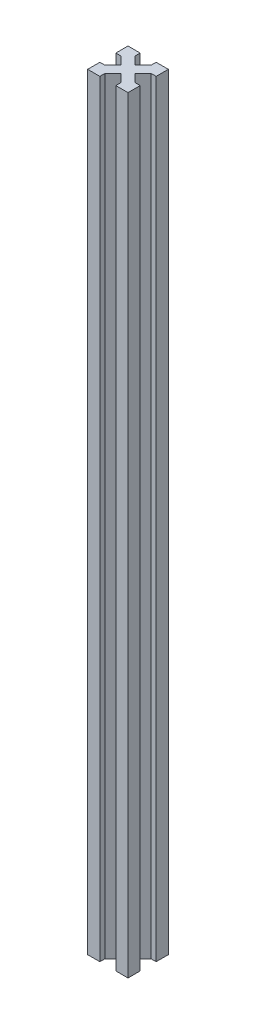
ISO-10303-21;
HEADER;
FILE_DESCRIPTION(('STEP AP214'),'2;1');
FILE_NAME('part.step','',(''),(''),'','','');
FILE_SCHEMA(('AUTOMOTIVE_DESIGN { 1 0 10303 214 1 1 1 1 }'));
ENDSEC;
DATA;
#1=APPLICATION_CONTEXT('core data for automotive mechanical design processes');
#2=APPLICATION_PROTOCOL_DEFINITION('international standard','automotive_design',2000,#1);
#3=PRODUCT_CONTEXT('',#1,'mechanical');
#4=PRODUCT('Part','Part','',(#3));
#5=PRODUCT_RELATED_PRODUCT_CATEGORY('part','',(#4));
#6=PRODUCT_DEFINITION_FORMATION('','',#4);
#7=PRODUCT_DEFINITION_CONTEXT('part definition',#1,'design');
#8=PRODUCT_DEFINITION('design','',#6,#7);
#9=PRODUCT_DEFINITION_SHAPE('','',#8);
#10=(LENGTH_UNIT() NAMED_UNIT(*) SI_UNIT(.MILLI.,.METRE.));
#11=(NAMED_UNIT(*) PLANE_ANGLE_UNIT() SI_UNIT($,.RADIAN.));
#12=(NAMED_UNIT(*) SI_UNIT($,.STERADIAN.) SOLID_ANGLE_UNIT());
#13=UNCERTAINTY_MEASURE_WITH_UNIT(LENGTH_MEASURE(1.E-05),#10,'distance_accuracy_value','');
#14=(GEOMETRIC_REPRESENTATION_CONTEXT(3) GLOBAL_UNCERTAINTY_ASSIGNED_CONTEXT((#13)) GLOBAL_UNIT_ASSIGNED_CONTEXT((#10,
#11,#12)) REPRESENTATION_CONTEXT('',''));
#15=CARTESIAN_POINT('',(0.,0.,0.));
#16=DIRECTION('',(0.,0.,1.));
#17=DIRECTION('',(1.,0.,0.));
#18=AXIS2_PLACEMENT_3D('',#15,#16,#17);
#19=CARTESIAN_POINT('',(-11.7677669529664,380.,-11.7677669529664));
#20=DIRECTION('',(0.707106781186548,0.,0.707106781186547));
#21=DIRECTION('',(0.707106781186547,0.,-0.707106781186548));
#22=AXIS2_PLACEMENT_3D('',#19,#20,#21);
#23=PLANE('',#22);
#24=DIRECTION('',(-0.707106781186547,0.,0.707106781186548));
#25=VECTOR('',#24,1.);
#26=CARTESIAN_POINT('',(-11.7677669529664,0.,-11.7677669529664));
#27=LINE('',#26,#25);
#28=CARTESIAN_POINT('',(-13.5355339059327,0.,-10.));
#29=VERTEX_POINT('',#28);
#30=CARTESIAN_POINT('',(-17.5,0.,-6.03553390593274));
#31=VERTEX_POINT('',#30);
#32=EDGE_CURVE('E231',#29,#31,#27,.T.);
#33=ORIENTED_EDGE('',*,*,#32,.T.);
#34=DIRECTION('',(0.,-1.,0.));
#35=VECTOR('',#34,1.);
#36=CARTESIAN_POINT('',(-17.5,380.,-6.03553390593274));
#37=LINE('',#36,#35);
#38=CARTESIAN_POINT('',(-17.5,380.,-6.03553390593274));
#39=VERTEX_POINT('',#38);
#40=EDGE_CURVE('E11',#39,#31,#37,.T.);
#41=ORIENTED_EDGE('',*,*,#40,.F.);
#42=DIRECTION('',(-0.707106781186547,0.,0.707106781186548));
#43=VECTOR('',#42,1.);
#44=CARTESIAN_POINT('',(-11.7677669529664,380.,-11.7677669529664));
#45=LINE('',#44,#43);
#46=CARTESIAN_POINT('',(-13.5355339059327,380.,-10.));
#47=VERTEX_POINT('',#46);
#48=EDGE_CURVE('E294',#47,#39,#45,.T.);
#49=ORIENTED_EDGE('',*,*,#48,.F.);
#50=DIRECTION('',(0.,-1.,0.));
#51=VECTOR('',#50,1.);
#52=CARTESIAN_POINT('',(-13.5355339059327,380.,-10.));
#53=LINE('',#52,#51);
#54=EDGE_CURVE('E227',#47,#29,#53,.T.);
#55=ORIENTED_EDGE('',*,*,#54,.T.);
#56=EDGE_LOOP('',(#33,#41,#49,#55));
#57=FACE_BOUND('',#56,.T.);
#58=ADVANCED_FACE('F41',(#57),#23,.F.);
#59=CARTESIAN_POINT('',(0.,380.,-6.03553390593274));
#60=DIRECTION('',(0.,0.,1.));
#61=DIRECTION('',(1.,0.,0.));
#62=AXIS2_PLACEMENT_3D('',#59,#60,#61);
#63=PLANE('',#62);
#64=DIRECTION('',(-1.,0.,0.));
#65=VECTOR('',#64,1.);
#66=CARTESIAN_POINT('',(0.,0.,-6.03553390593274));
#67=LINE('',#66,#65);
#68=CARTESIAN_POINT('',(-20.,0.,-6.03553390593274));
#69=VERTEX_POINT('',#68);
#70=EDGE_CURVE('E234',#31,#69,#67,.T.);
#71=ORIENTED_EDGE('',*,*,#70,.T.);
#72=DIRECTION('',(0.,-1.,0.));
#73=VECTOR('',#72,1.);
#74=CARTESIAN_POINT('',(-20.,380.,-6.03553390593274));
#75=LINE('',#74,#73);
#76=CARTESIAN_POINT('',(-20.,380.,-6.03553390593274));
#77=VERTEX_POINT('',#76);
#78=EDGE_CURVE('E49',#77,#69,#75,.T.);
#79=ORIENTED_EDGE('',*,*,#78,.F.);
#80=DIRECTION('',(-1.,0.,0.));
#81=VECTOR('',#80,1.);
#82=CARTESIAN_POINT('',(0.,380.,-6.03553390593274));
#83=LINE('',#82,#81);
#84=EDGE_CURVE('E144',#39,#77,#83,.T.);
#85=ORIENTED_EDGE('',*,*,#84,.F.);
#86=ORIENTED_EDGE('',*,*,#40,.T.);
#87=EDGE_LOOP('',(#71,#79,#85,#86));
#88=FACE_BOUND('',#87,.T.);
#89=ADVANCED_FACE('F343',(#88),#63,.F.);
#90=CARTESIAN_POINT('',(-20.,380.,0.));
#91=DIRECTION('',(-1.,0.,0.));
#92=DIRECTION('',(0.,0.,1.));
#93=AXIS2_PLACEMENT_3D('',#90,#91,#92);
#94=PLANE('',#93);
#95=DIRECTION('',(0.,0.,-1.));
#96=VECTOR('',#95,1.);
#97=CARTESIAN_POINT('',(-20.,0.,0.));
#98=LINE('',#97,#96);
#99=CARTESIAN_POINT('',(-20.,0.,0.));
#100=VERTEX_POINT('',#99);
#101=EDGE_CURVE('E237',#100,#69,#98,.T.);
#102=ORIENTED_EDGE('',*,*,#101,.F.);
#103=DIRECTION('',(0.,-1.,0.));
#104=VECTOR('',#103,1.);
#105=CARTESIAN_POINT('',(-20.,380.,0.));
#106=LINE('',#105,#104);
#107=CARTESIAN_POINT('',(-20.,380.,0.));
#108=VERTEX_POINT('',#107);
#109=EDGE_CURVE('E336',#108,#100,#106,.T.);
#110=ORIENTED_EDGE('',*,*,#109,.F.);
#111=DIRECTION('',(0.,0.,-1.));
#112=VECTOR('',#111,1.);
#113=CARTESIAN_POINT('',(-20.,380.,0.));
#114=LINE('',#113,#112);
#115=EDGE_CURVE('E342',#108,#77,#114,.T.);
#116=ORIENTED_EDGE('',*,*,#115,.T.);
#117=ORIENTED_EDGE('',*,*,#78,.T.);
#118=EDGE_LOOP('',(#102,#110,#116,#117));
#119=FACE_BOUND('',#118,.T.);
#120=ADVANCED_FACE('F340',(#119),#94,.T.);
#121=CARTESIAN_POINT('',(0.,380.,0.));
#122=DIRECTION('',(0.,0.,1.));
#123=DIRECTION('',(1.,0.,0.));
#124=AXIS2_PLACEMENT_3D('',#121,#122,#123);
#125=PLANE('',#124);
#126=DIRECTION('',(-1.,0.,0.));
#127=VECTOR('',#126,1.);
#128=CARTESIAN_POINT('',(0.,0.,0.));
#129=LINE('',#128,#127);
#130=CARTESIAN_POINT('',(-13.9644660940673,0.,0.));
#131=VERTEX_POINT('',#130);
#132=EDGE_CURVE('E240',#131,#100,#129,.T.);
#133=ORIENTED_EDGE('',*,*,#132,.F.);
#134=DIRECTION('',(0.,-1.,0.));
#135=VECTOR('',#134,1.);
#136=CARTESIAN_POINT('',(-13.9644660940673,380.,0.));
#137=LINE('',#136,#135);
#138=CARTESIAN_POINT('',(-13.9644660940673,380.,0.));
#139=VERTEX_POINT('',#138);
#140=EDGE_CURVE('E334',#139,#131,#137,.T.);
#141=ORIENTED_EDGE('',*,*,#140,.F.);
#142=DIRECTION('',(-1.,0.,0.));
#143=VECTOR('',#142,1.);
#144=CARTESIAN_POINT('',(0.,380.,0.));
#145=LINE('',#144,#143);
#146=EDGE_CURVE('E354',#139,#108,#145,.T.);
#147=ORIENTED_EDGE('',*,*,#146,.T.);
#148=ORIENTED_EDGE('',*,*,#109,.T.);
#149=EDGE_LOOP('',(#133,#141,#147,#148));
#150=FACE_BOUND('',#149,.T.);
#151=ADVANCED_FACE('F351',(#150),#125,.T.);
#152=CARTESIAN_POINT('',(-13.9644660940673,380.,0.));
#153=DIRECTION('',(1.,0.,0.));
#154=DIRECTION('',(0.,0.,-1.));
#155=AXIS2_PLACEMENT_3D('',#152,#153,#154);
#156=PLANE('',#155);
#157=DIRECTION('',(0.,0.,1.));
#158=VECTOR('',#157,1.);
#159=CARTESIAN_POINT('',(-13.9644660940673,0.,0.));
#160=LINE('',#159,#158);
#161=CARTESIAN_POINT('',(-13.9644660940673,0.,-2.5));
#162=VERTEX_POINT('',#161);
#163=EDGE_CURVE('E243',#162,#131,#160,.T.);
#164=ORIENTED_EDGE('',*,*,#163,.F.);
#165=DIRECTION('',(0.,-1.,0.));
#166=VECTOR('',#165,1.);
#167=CARTESIAN_POINT('',(-13.9644660940673,380.,-2.5));
#168=LINE('',#167,#166);
#169=CARTESIAN_POINT('',(-13.9644660940673,380.,-2.5));
#170=VERTEX_POINT('',#169);
#171=EDGE_CURVE('E332',#170,#162,#168,.T.);
#172=ORIENTED_EDGE('',*,*,#171,.F.);
#173=DIRECTION('',(0.,0.,1.));
#174=VECTOR('',#173,1.);
#175=CARTESIAN_POINT('',(-13.9644660940673,380.,0.));
#176=LINE('',#175,#174);
#177=EDGE_CURVE('E358',#170,#139,#176,.T.);
#178=ORIENTED_EDGE('',*,*,#177,.T.);
#179=ORIENTED_EDGE('',*,*,#140,.T.);
#180=EDGE_LOOP('',(#164,#172,#178,#179));
#181=FACE_BOUND('',#180,.T.);
#182=ADVANCED_FACE('F432',(#181),#156,.T.);
#183=CARTESIAN_POINT('',(-8.23223304703363,380.,-8.23223304703363));
#184=DIRECTION('',(0.707106781186548,0.,0.707106781186547));
#185=DIRECTION('',(0.707106781186547,0.,-0.707106781186548));
#186=AXIS2_PLACEMENT_3D('',#183,#184,#185);
#187=PLANE('',#186);
#188=DIRECTION('',(-0.707106781186547,0.,0.707106781186548));
#189=VECTOR('',#188,1.);
#190=CARTESIAN_POINT('',(-8.23223304703363,0.,-8.23223304703363));
#191=LINE('',#190,#189);
#192=CARTESIAN_POINT('',(-10.,0.,-6.46446609406726));
#193=VERTEX_POINT('',#192);
#194=EDGE_CURVE('E246',#193,#162,#191,.T.);
#195=ORIENTED_EDGE('',*,*,#194,.F.);
#196=DIRECTION('',(0.,-1.,0.));
#197=VECTOR('',#196,1.);
#198=CARTESIAN_POINT('',(-10.,380.,-6.46446609406726));
#199=LINE('',#198,#197);
#200=CARTESIAN_POINT('',(-10.,380.,-6.46446609406726));
#201=VERTEX_POINT('',#200);
#202=EDGE_CURVE('E330',#201,#193,#199,.T.);
#203=ORIENTED_EDGE('',*,*,#202,.F.);
#204=DIRECTION('',(-0.707106781186547,0.,0.707106781186548));
#205=VECTOR('',#204,1.);
#206=CARTESIAN_POINT('',(-8.23223304703363,380.,-8.23223304703363));
#207=LINE('',#206,#205);
#208=EDGE_CURVE('E364',#201,#170,#207,.T.);
#209=ORIENTED_EDGE('',*,*,#208,.T.);
#210=ORIENTED_EDGE('',*,*,#171,.T.);
#211=EDGE_LOOP('',(#195,#203,#209,#210));
#212=FACE_BOUND('',#211,.T.);
#213=ADVANCED_FACE('F435',(#212),#187,.T.);
#214=CARTESIAN_POINT('',(-1.76776695296637,380.,1.76776695296637));
#215=DIRECTION('',(0.707106781186548,0.,-0.707106781186548));
#216=DIRECTION('',(-0.707106781186548,0.,-0.707106781186548));
#217=AXIS2_PLACEMENT_3D('',#214,#215,#216);
#218=PLANE('',#217);
#219=DIRECTION('',(0.707106781186548,0.,0.707106781186548));
#220=VECTOR('',#219,1.);
#221=CARTESIAN_POINT('',(-1.76776695296637,0.,1.76776695296637));
#222=LINE('',#221,#220);
#223=CARTESIAN_POINT('',(-6.03553390593274,0.,-2.5));
#224=VERTEX_POINT('',#223);
#225=EDGE_CURVE('E249',#193,#224,#222,.T.);
#226=ORIENTED_EDGE('',*,*,#225,.T.);
#227=DIRECTION('',(0.,-1.,0.));
#228=VECTOR('',#227,1.);
#229=CARTESIAN_POINT('',(-6.03553390593274,380.,-2.5));
#230=LINE('',#229,#228);
#231=CARTESIAN_POINT('',(-6.03553390593274,380.,-2.5));
#232=VERTEX_POINT('',#231);
#233=EDGE_CURVE('E327',#232,#224,#230,.T.);
#234=ORIENTED_EDGE('',*,*,#233,.F.);
#235=DIRECTION('',(0.707106781186548,0.,0.707106781186548));
#236=VECTOR('',#235,1.);
#237=CARTESIAN_POINT('',(-1.76776695296637,380.,1.76776695296637));
#238=LINE('',#237,#236);
#239=EDGE_CURVE('E367',#201,#232,#238,.T.);
#240=ORIENTED_EDGE('',*,*,#239,.F.);
#241=ORIENTED_EDGE('',*,*,#202,.T.);
#242=EDGE_LOOP('',(#226,#234,#240,#241));
#243=FACE_BOUND('',#242,.T.);
#244=ADVANCED_FACE('F439',(#243),#218,.F.);
#245=CARTESIAN_POINT('',(-6.03553390593274,380.,0.));
#246=DIRECTION('',(1.,0.,0.));
#247=DIRECTION('',(0.,0.,-1.));
#248=AXIS2_PLACEMENT_3D('',#245,#246,#247);
#249=PLANE('',#248);
#250=DIRECTION('',(0.,0.,1.));
#251=VECTOR('',#250,1.);
#252=CARTESIAN_POINT('',(-6.03553390593274,0.,0.));
#253=LINE('',#252,#251);
#254=CARTESIAN_POINT('',(-6.03553390593274,0.,0.));
#255=VERTEX_POINT('',#254);
#256=EDGE_CURVE('E251',#224,#255,#253,.T.);
#257=ORIENTED_EDGE('',*,*,#256,.T.);
#258=DIRECTION('',(0.,-1.,0.));
#259=VECTOR('',#258,1.);
#260=CARTESIAN_POINT('',(-6.03553390593274,380.,0.));
#261=LINE('',#260,#259);
#262=CARTESIAN_POINT('',(-6.03553390593274,380.,0.));
#263=VERTEX_POINT('',#262);
#264=EDGE_CURVE('E325',#263,#255,#261,.T.);
#265=ORIENTED_EDGE('',*,*,#264,.F.);
#266=DIRECTION('',(0.,0.,1.));
#267=VECTOR('',#266,1.);
#268=CARTESIAN_POINT('',(-6.03553390593274,380.,0.));
#269=LINE('',#268,#267);
#270=EDGE_CURVE('E369',#232,#263,#269,.T.);
#271=ORIENTED_EDGE('',*,*,#270,.F.);
#272=ORIENTED_EDGE('',*,*,#233,.T.);
#273=EDGE_LOOP('',(#257,#265,#271,#272));
#274=FACE_BOUND('',#273,.T.);
#275=ADVANCED_FACE('F443',(#274),#249,.F.);
#276=CARTESIAN_POINT('',(0.,380.,0.));
#277=DIRECTION('',(0.,0.,1.));
#278=DIRECTION('',(1.,0.,0.));
#279=AXIS2_PLACEMENT_3D('',#276,#277,#278);
#280=PLANE('',#279);
#281=DIRECTION('',(-1.,0.,0.));
#282=VECTOR('',#281,1.);
#283=CARTESIAN_POINT('',(0.,0.,0.));
#284=LINE('',#283,#282);
#285=CARTESIAN_POINT('',(0.,0.,0.));
#286=VERTEX_POINT('',#285);
#287=EDGE_CURVE('E254',#286,#255,#284,.T.);
#288=ORIENTED_EDGE('',*,*,#287,.F.);
#289=DIRECTION('',(0.,-1.,0.));
#290=VECTOR('',#289,1.);
#291=CARTESIAN_POINT('',(0.,380.,0.));
#292=LINE('',#291,#290);
#293=CARTESIAN_POINT('',(0.,380.,0.));
#294=VERTEX_POINT('',#293);
#295=EDGE_CURVE('E323',#294,#286,#292,.T.);
#296=ORIENTED_EDGE('',*,*,#295,.F.);
#297=DIRECTION('',(-1.,0.,0.));
#298=VECTOR('',#297,1.);
#299=CARTESIAN_POINT('',(0.,380.,0.));
#300=LINE('',#299,#298);
#301=EDGE_CURVE('E371',#294,#263,#300,.T.);
#302=ORIENTED_EDGE('',*,*,#301,.T.);
#303=ORIENTED_EDGE('',*,*,#264,.T.);
#304=EDGE_LOOP('',(#288,#296,#302,#303));
#305=FACE_BOUND('',#304,.T.);
#306=ADVANCED_FACE('F447',(#305),#280,.T.);
#307=CARTESIAN_POINT('',(0.,380.,0.));
#308=DIRECTION('',(-1.,0.,0.));
#309=DIRECTION('',(0.,0.,1.));
#310=AXIS2_PLACEMENT_3D('',#307,#308,#309);
#311=PLANE('',#310);
#312=DIRECTION('',(0.,0.,-1.));
#313=VECTOR('',#312,1.);
#314=CARTESIAN_POINT('',(0.,0.,0.));
#315=LINE('',#314,#313);
#316=CARTESIAN_POINT('',(0.,0.,-6.03553390593274));
#317=VERTEX_POINT('',#316);
#318=EDGE_CURVE('E257',#286,#317,#315,.T.);
#319=ORIENTED_EDGE('',*,*,#318,.T.);
#320=DIRECTION('',(0.,-1.,0.));
#321=VECTOR('',#320,1.);
#322=CARTESIAN_POINT('',(0.,380.,-6.03553390593274));
#323=LINE('',#322,#321);
#324=CARTESIAN_POINT('',(0.,380.,-6.03553390593274));
#325=VERTEX_POINT('',#324);
#326=EDGE_CURVE('E321',#325,#317,#323,.T.);
#327=ORIENTED_EDGE('',*,*,#326,.F.);
#328=DIRECTION('',(0.,0.,-1.));
#329=VECTOR('',#328,1.);
#330=CARTESIAN_POINT('',(0.,380.,0.));
#331=LINE('',#330,#329);
#332=EDGE_CURVE('E374',#294,#325,#331,.T.);
#333=ORIENTED_EDGE('',*,*,#332,.F.);
#334=ORIENTED_EDGE('',*,*,#295,.T.);
#335=EDGE_LOOP('',(#319,#327,#333,#334));
#336=FACE_BOUND('',#335,.T.);
#337=ADVANCED_FACE('F451',(#336),#311,.F.);
#338=CARTESIAN_POINT('',(0.,380.,-6.03553390593275));
#339=DIRECTION('',(0.,0.,-1.));
#340=DIRECTION('',(-1.,0.,0.));
#341=AXIS2_PLACEMENT_3D('',#338,#339,#340);
#342=PLANE('',#341);
#343=DIRECTION('',(1.,0.,0.));
#344=VECTOR('',#343,1.);
#345=CARTESIAN_POINT('',(0.,0.,-6.03553390593275));
#346=LINE('',#345,#344);
#347=CARTESIAN_POINT('',(-2.5,0.,-6.03553390593275));
#348=VERTEX_POINT('',#347);
#349=EDGE_CURVE('E260',#348,#317,#346,.T.);
#350=ORIENTED_EDGE('',*,*,#349,.F.);
#351=DIRECTION('',(0.,-1.,0.));
#352=VECTOR('',#351,1.);
#353=CARTESIAN_POINT('',(-2.5,380.,-6.03553390593275));
#354=LINE('',#353,#352);
#355=CARTESIAN_POINT('',(-2.5,380.,-6.03553390593275));
#356=VERTEX_POINT('',#355);
#357=EDGE_CURVE('E319',#356,#348,#354,.T.);
#358=ORIENTED_EDGE('',*,*,#357,.F.);
#359=DIRECTION('',(1.,0.,0.));
#360=VECTOR('',#359,1.);
#361=CARTESIAN_POINT('',(0.,380.,-6.03553390593275));
#362=LINE('',#361,#360);
#363=EDGE_CURVE('E376',#356,#325,#362,.T.);
#364=ORIENTED_EDGE('',*,*,#363,.T.);
#365=ORIENTED_EDGE('',*,*,#326,.T.);
#366=EDGE_LOOP('',(#350,#358,#364,#365));
#367=FACE_BOUND('',#366,.T.);
#368=ADVANCED_FACE('F455',(#367),#342,.T.);
#369=CARTESIAN_POINT('',(1.76776695296637,380.,-1.76776695296638));
#370=DIRECTION('',(0.707106781186547,0.,-0.707106781186548));
#371=DIRECTION('',(-0.707106781186548,0.,-0.707106781186547));
#372=AXIS2_PLACEMENT_3D('',#369,#370,#371);
#373=PLANE('',#372);
#374=DIRECTION('',(0.707106781186548,0.,0.707106781186547));
#375=VECTOR('',#374,1.);
#376=CARTESIAN_POINT('',(1.76776695296637,0.,-1.76776695296638));
#377=LINE('',#376,#375);
#378=CARTESIAN_POINT('',(-6.46446609406726,0.,-10.));
#379=VERTEX_POINT('',#378);
#380=EDGE_CURVE('E263',#379,#348,#377,.T.);
#381=ORIENTED_EDGE('',*,*,#380,.F.);
#382=DIRECTION('',(0.,-1.,0.));
#383=VECTOR('',#382,1.);
#384=CARTESIAN_POINT('',(-6.46446609406726,380.,-10.));
#385=LINE('',#384,#383);
#386=CARTESIAN_POINT('',(-6.46446609406726,380.,-10.));
#387=VERTEX_POINT('',#386);
#388=EDGE_CURVE('E317',#387,#379,#385,.T.);
#389=ORIENTED_EDGE('',*,*,#388,.F.);
#390=DIRECTION('',(0.707106781186548,0.,0.707106781186547));
#391=VECTOR('',#390,1.);
#392=CARTESIAN_POINT('',(1.76776695296637,380.,-1.76776695296638));
#393=LINE('',#392,#391);
#394=EDGE_CURVE('E379',#387,#356,#393,.T.);
#395=ORIENTED_EDGE('',*,*,#394,.T.);
#396=ORIENTED_EDGE('',*,*,#357,.T.);
#397=EDGE_LOOP('',(#381,#389,#395,#396));
#398=FACE_BOUND('',#397,.T.);
#399=ADVANCED_FACE('F459',(#398),#373,.T.);
#400=CARTESIAN_POINT('',(-8.23223304703363,380.,-8.23223304703363));
#401=DIRECTION('',(0.707106781186548,0.,0.707106781186547));
#402=DIRECTION('',(0.707106781186547,0.,-0.707106781186548));
#403=AXIS2_PLACEMENT_3D('',#400,#401,#402);
#404=PLANE('',#403);
#405=DIRECTION('',(-0.707106781186547,0.,0.707106781186548));
#406=VECTOR('',#405,1.);
#407=CARTESIAN_POINT('',(-8.23223304703363,0.,-8.23223304703363));
#408=LINE('',#407,#406);
#409=CARTESIAN_POINT('',(-2.5,0.,-13.9644660940673));
#410=VERTEX_POINT('',#409);
#411=EDGE_CURVE('E266',#410,#379,#408,.T.);
#412=ORIENTED_EDGE('',*,*,#411,.F.);
#413=DIRECTION('',(0.,-1.,0.));
#414=VECTOR('',#413,1.);
#415=CARTESIAN_POINT('',(-2.5,380.,-13.9644660940673));
#416=LINE('',#415,#414);
#417=CARTESIAN_POINT('',(-2.5,380.,-13.9644660940673));
#418=VERTEX_POINT('',#417);
#419=EDGE_CURVE('E315',#418,#410,#416,.T.);
#420=ORIENTED_EDGE('',*,*,#419,.F.);
#421=DIRECTION('',(-0.707106781186547,0.,0.707106781186548));
#422=VECTOR('',#421,1.);
#423=CARTESIAN_POINT('',(-8.23223304703363,380.,-8.23223304703363));
#424=LINE('',#423,#422);
#425=EDGE_CURVE('E382',#418,#387,#424,.T.);
#426=ORIENTED_EDGE('',*,*,#425,.T.);
#427=ORIENTED_EDGE('',*,*,#388,.T.);
#428=EDGE_LOOP('',(#412,#420,#426,#427));
#429=FACE_BOUND('',#428,.T.);
#430=ADVANCED_FACE('F463',(#429),#404,.T.);
#431=CARTESIAN_POINT('',(0.,380.,-13.9644660940673));
#432=DIRECTION('',(0.,0.,-1.));
#433=DIRECTION('',(-1.,0.,0.));
#434=AXIS2_PLACEMENT_3D('',#431,#432,#433);
#435=PLANE('',#434);
#436=DIRECTION('',(1.,0.,0.));
#437=VECTOR('',#436,1.);
#438=CARTESIAN_POINT('',(0.,0.,-13.9644660940673));
#439=LINE('',#438,#437);
#440=CARTESIAN_POINT('',(0.,0.,-13.9644660940673));
#441=VERTEX_POINT('',#440);
#442=EDGE_CURVE('E269',#410,#441,#439,.T.);
#443=ORIENTED_EDGE('',*,*,#442,.T.);
#444=DIRECTION('',(0.,-1.,0.));
#445=VECTOR('',#444,1.);
#446=CARTESIAN_POINT('',(0.,380.,-13.9644660940673));
#447=LINE('',#446,#445);
#448=CARTESIAN_POINT('',(0.,380.,-13.9644660940673));
#449=VERTEX_POINT('',#448);
#450=EDGE_CURVE('E312',#449,#441,#447,.T.);
#451=ORIENTED_EDGE('',*,*,#450,.F.);
#452=DIRECTION('',(1.,0.,0.));
#453=VECTOR('',#452,1.);
#454=CARTESIAN_POINT('',(0.,380.,-13.9644660940673));
#455=LINE('',#454,#453);
#456=EDGE_CURVE('E385',#418,#449,#455,.T.);
#457=ORIENTED_EDGE('',*,*,#456,.F.);
#458=ORIENTED_EDGE('',*,*,#419,.T.);
#459=EDGE_LOOP('',(#443,#451,#457,#458));
#460=FACE_BOUND('',#459,.T.);
#461=ADVANCED_FACE('F467',(#460),#435,.F.);
#462=CARTESIAN_POINT('',(0.,380.,0.));
#463=DIRECTION('',(-1.,0.,0.));
#464=DIRECTION('',(0.,0.,1.));
#465=AXIS2_PLACEMENT_3D('',#462,#463,#464);
#466=PLANE('',#465);
#467=DIRECTION('',(0.,0.,-1.));
#468=VECTOR('',#467,1.);
#469=CARTESIAN_POINT('',(0.,0.,0.));
#470=LINE('',#469,#468);
#471=CARTESIAN_POINT('',(0.,0.,-20.));
#472=VERTEX_POINT('',#471);
#473=EDGE_CURVE('E271',#441,#472,#470,.T.);
#474=ORIENTED_EDGE('',*,*,#473,.T.);
#475=DIRECTION('',(0.,-1.,0.));
#476=VECTOR('',#475,1.);
#477=CARTESIAN_POINT('',(0.,380.,-20.));
#478=LINE('',#477,#476);
#479=CARTESIAN_POINT('',(0.,380.,-20.));
#480=VERTEX_POINT('',#479);
#481=EDGE_CURVE('E309',#480,#472,#478,.T.);
#482=ORIENTED_EDGE('',*,*,#481,.F.);
#483=DIRECTION('',(0.,0.,-1.));
#484=VECTOR('',#483,1.);
#485=CARTESIAN_POINT('',(0.,380.,0.));
#486=LINE('',#485,#484);
#487=EDGE_CURVE('E387',#449,#480,#486,.T.);
#488=ORIENTED_EDGE('',*,*,#487,.F.);
#489=ORIENTED_EDGE('',*,*,#450,.T.);
#490=EDGE_LOOP('',(#474,#482,#488,#489));
#491=FACE_BOUND('',#490,.T.);
#492=ADVANCED_FACE('F471',(#491),#466,.F.);
#493=CARTESIAN_POINT('',(0.,380.,-20.));
#494=DIRECTION('',(0.,0.,1.));
#495=DIRECTION('',(1.,0.,0.));
#496=AXIS2_PLACEMENT_3D('',#493,#494,#495);
#497=PLANE('',#496);
#498=DIRECTION('',(-1.,0.,0.));
#499=VECTOR('',#498,1.);
#500=CARTESIAN_POINT('',(0.,0.,-20.));
#501=LINE('',#500,#499);
#502=CARTESIAN_POINT('',(-6.03553390593274,0.,-20.));
#503=VERTEX_POINT('',#502);
#504=EDGE_CURVE('E273',#472,#503,#501,.T.);
#505=ORIENTED_EDGE('',*,*,#504,.T.);
#506=DIRECTION('',(0.,-1.,0.));
#507=VECTOR('',#506,1.);
#508=CARTESIAN_POINT('',(-6.03553390593274,380.,-20.));
#509=LINE('',#508,#507);
#510=CARTESIAN_POINT('',(-6.03553390593274,380.,-20.));
#511=VERTEX_POINT('',#510);
#512=EDGE_CURVE('E307',#511,#503,#509,.T.);
#513=ORIENTED_EDGE('',*,*,#512,.F.);
#514=DIRECTION('',(-1.,0.,0.));
#515=VECTOR('',#514,1.);
#516=CARTESIAN_POINT('',(0.,380.,-20.));
#517=LINE('',#516,#515);
#518=EDGE_CURVE('E389',#480,#511,#517,.T.);
#519=ORIENTED_EDGE('',*,*,#518,.F.);
#520=ORIENTED_EDGE('',*,*,#481,.T.);
#521=EDGE_LOOP('',(#505,#513,#519,#520));
#522=FACE_BOUND('',#521,.T.);
#523=ADVANCED_FACE('F475',(#522),#497,.F.);
#524=CARTESIAN_POINT('',(-6.03553390593275,380.,0.));
#525=DIRECTION('',(-1.,0.,0.));
#526=DIRECTION('',(0.,0.,1.));
#527=AXIS2_PLACEMENT_3D('',#524,#525,#526);
#528=PLANE('',#527);
#529=DIRECTION('',(0.,0.,-1.));
#530=VECTOR('',#529,1.);
#531=CARTESIAN_POINT('',(-6.03553390593275,0.,0.));
#532=LINE('',#531,#530);
#533=CARTESIAN_POINT('',(-6.03553390593274,0.,-17.5));
#534=VERTEX_POINT('',#533);
#535=EDGE_CURVE('E276',#534,#503,#532,.T.);
#536=ORIENTED_EDGE('',*,*,#535,.F.);
#537=DIRECTION('',(0.,-1.,0.));
#538=VECTOR('',#537,1.);
#539=CARTESIAN_POINT('',(-6.03553390593274,380.,-17.5));
#540=LINE('',#539,#538);
#541=CARTESIAN_POINT('',(-6.03553390593274,380.,-17.5));
#542=VERTEX_POINT('',#541);
#543=EDGE_CURVE('E305',#542,#534,#540,.T.);
#544=ORIENTED_EDGE('',*,*,#543,.F.);
#545=DIRECTION('',(0.,0.,-1.));
#546=VECTOR('',#545,1.);
#547=CARTESIAN_POINT('',(-6.03553390593275,380.,0.));
#548=LINE('',#547,#546);
#549=EDGE_CURVE('E391',#542,#511,#548,.T.);
#550=ORIENTED_EDGE('',*,*,#549,.T.);
#551=ORIENTED_EDGE('',*,*,#512,.T.);
#552=EDGE_LOOP('',(#536,#544,#550,#551));
#553=FACE_BOUND('',#552,.T.);
#554=ADVANCED_FACE('F479',(#553),#528,.T.);
#555=CARTESIAN_POINT('',(-11.7677669529664,380.,-11.7677669529664));
#556=DIRECTION('',(0.707106781186548,0.,0.707106781186547));
#557=DIRECTION('',(0.707106781186547,0.,-0.707106781186548));
#558=AXIS2_PLACEMENT_3D('',#555,#556,#557);
#559=PLANE('',#558);
#560=DIRECTION('',(-0.707106781186547,0.,0.707106781186548));
#561=VECTOR('',#560,1.);
#562=CARTESIAN_POINT('',(-11.7677669529664,0.,-11.7677669529664));
#563=LINE('',#562,#561);
#564=CARTESIAN_POINT('',(-10.,0.,-13.5355339059327));
#565=VERTEX_POINT('',#564);
#566=EDGE_CURVE('E279',#534,#565,#563,.T.);
#567=ORIENTED_EDGE('',*,*,#566,.T.);
#568=DIRECTION('',(0.,-1.,0.));
#569=VECTOR('',#568,1.);
#570=CARTESIAN_POINT('',(-10.,380.,-13.5355339059327));
#571=LINE('',#570,#569);
#572=CARTESIAN_POINT('',(-10.,380.,-13.5355339059327));
#573=VERTEX_POINT('',#572);
#574=EDGE_CURVE('E303',#573,#565,#571,.T.);
#575=ORIENTED_EDGE('',*,*,#574,.F.);
#576=DIRECTION('',(-0.707106781186547,0.,0.707106781186548));
#577=VECTOR('',#576,1.);
#578=CARTESIAN_POINT('',(-11.7677669529664,380.,-11.7677669529664));
#579=LINE('',#578,#577);
#580=EDGE_CURVE('E394',#542,#573,#579,.T.);
#581=ORIENTED_EDGE('',*,*,#580,.F.);
#582=ORIENTED_EDGE('',*,*,#543,.T.);
#583=EDGE_LOOP('',(#567,#575,#581,#582));
#584=FACE_BOUND('',#583,.T.);
#585=ADVANCED_FACE('F483',(#584),#559,.F.);
#586=CARTESIAN_POINT('',(1.76776695296637,380.,-1.76776695296638));
#587=DIRECTION('',(0.707106781186547,0.,-0.707106781186548));
#588=DIRECTION('',(-0.707106781186548,0.,-0.707106781186547));
#589=AXIS2_PLACEMENT_3D('',#586,#587,#588);
#590=PLANE('',#589);
#591=DIRECTION('',(0.707106781186548,0.,0.707106781186547));
#592=VECTOR('',#591,1.);
#593=CARTESIAN_POINT('',(1.76776695296637,0.,-1.76776695296638));
#594=LINE('',#593,#592);
#595=CARTESIAN_POINT('',(-13.9644660940673,0.,-17.5));
#596=VERTEX_POINT('',#595);
#597=EDGE_CURVE('E282',#596,#565,#594,.T.);
#598=ORIENTED_EDGE('',*,*,#597,.F.);
#599=DIRECTION('',(0.,-1.,0.));
#600=VECTOR('',#599,1.);
#601=CARTESIAN_POINT('',(-13.9644660940673,380.,-17.5));
#602=LINE('',#601,#600);
#603=CARTESIAN_POINT('',(-13.9644660940673,380.,-17.5));
#604=VERTEX_POINT('',#603);
#605=EDGE_CURVE('E301',#604,#596,#602,.T.);
#606=ORIENTED_EDGE('',*,*,#605,.F.);
#607=DIRECTION('',(0.707106781186548,0.,0.707106781186547));
#608=VECTOR('',#607,1.);
#609=CARTESIAN_POINT('',(1.76776695296637,380.,-1.76776695296638));
#610=LINE('',#609,#608);
#611=EDGE_CURVE('E396',#604,#573,#610,.T.);
#612=ORIENTED_EDGE('',*,*,#611,.T.);
#613=ORIENTED_EDGE('',*,*,#574,.T.);
#614=EDGE_LOOP('',(#598,#606,#612,#613));
#615=FACE_BOUND('',#614,.T.);
#616=ADVANCED_FACE('F487',(#615),#590,.T.);
#617=CARTESIAN_POINT('',(-13.9644660940672,380.,0.));
#618=DIRECTION('',(-1.,0.,0.));
#619=DIRECTION('',(0.,0.,1.));
#620=AXIS2_PLACEMENT_3D('',#617,#618,#619);
#621=PLANE('',#620);
#622=DIRECTION('',(0.,0.,-1.));
#623=VECTOR('',#622,1.);
#624=CARTESIAN_POINT('',(-13.9644660940672,0.,0.));
#625=LINE('',#624,#623);
#626=CARTESIAN_POINT('',(-13.9644660940673,0.,-20.));
#627=VERTEX_POINT('',#626);
#628=EDGE_CURVE('E285',#596,#627,#625,.T.);
#629=ORIENTED_EDGE('',*,*,#628,.T.);
#630=DIRECTION('',(0.,-1.,0.));
#631=VECTOR('',#630,1.);
#632=CARTESIAN_POINT('',(-13.9644660940673,380.,-20.));
#633=LINE('',#632,#631);
#634=CARTESIAN_POINT('',(-13.9644660940673,380.,-20.));
#635=VERTEX_POINT('',#634);
#636=EDGE_CURVE('E298',#635,#627,#633,.T.);
#637=ORIENTED_EDGE('',*,*,#636,.F.);
#638=DIRECTION('',(0.,0.,-1.));
#639=VECTOR('',#638,1.);
#640=CARTESIAN_POINT('',(-13.9644660940672,380.,0.));
#641=LINE('',#640,#639);
#642=EDGE_CURVE('E399',#604,#635,#641,.T.);
#643=ORIENTED_EDGE('',*,*,#642,.F.);
#644=ORIENTED_EDGE('',*,*,#605,.T.);
#645=EDGE_LOOP('',(#629,#637,#643,#644));
#646=FACE_BOUND('',#645,.T.);
#647=ADVANCED_FACE('F404',(#646),#621,.F.);
#648=CARTESIAN_POINT('',(0.,380.,-20.));
#649=DIRECTION('',(0.,0.,1.));
#650=DIRECTION('',(1.,0.,0.));
#651=AXIS2_PLACEMENT_3D('',#648,#649,#650);
#652=PLANE('',#651);
#653=DIRECTION('',(-1.,0.,0.));
#654=VECTOR('',#653,1.);
#655=CARTESIAN_POINT('',(0.,0.,-20.));
#656=LINE('',#655,#654);
#657=CARTESIAN_POINT('',(-20.,0.,-20.));
#658=VERTEX_POINT('',#657);
#659=EDGE_CURVE('E287',#627,#658,#656,.T.);
#660=ORIENTED_EDGE('',*,*,#659,.T.);
#661=DIRECTION('',(0.,-1.,0.));
#662=VECTOR('',#661,1.);
#663=CARTESIAN_POINT('',(-20.,380.,-20.));
#664=LINE('',#663,#662);
#665=CARTESIAN_POINT('',(-20.,380.,-20.));
#666=VERTEX_POINT('',#665);
#667=EDGE_CURVE('E217',#666,#658,#664,.T.);
#668=ORIENTED_EDGE('',*,*,#667,.F.);
#669=DIRECTION('',(-1.,0.,0.));
#670=VECTOR('',#669,1.);
#671=CARTESIAN_POINT('',(0.,380.,-20.));
#672=LINE('',#671,#670);
#673=EDGE_CURVE('E222',#635,#666,#672,.T.);
#674=ORIENTED_EDGE('',*,*,#673,.F.);
#675=ORIENTED_EDGE('',*,*,#636,.T.);
#676=EDGE_LOOP('',(#660,#668,#674,#675));
#677=FACE_BOUND('',#676,.T.);
#678=ADVANCED_FACE('F408',(#677),#652,.F.);
#679=CARTESIAN_POINT('',(-20.,380.,0.));
#680=DIRECTION('',(-1.,0.,0.));
#681=DIRECTION('',(0.,0.,1.));
#682=AXIS2_PLACEMENT_3D('',#679,#680,#681);
#683=PLANE('',#682);
#684=DIRECTION('',(0.,0.,-1.));
#685=VECTOR('',#684,1.);
#686=CARTESIAN_POINT('',(-20.,0.,0.));
#687=LINE('',#686,#685);
#688=CARTESIAN_POINT('',(-20.,0.,-13.9644660940673));
#689=VERTEX_POINT('',#688);
#690=EDGE_CURVE('E212',#689,#658,#687,.T.);
#691=ORIENTED_EDGE('',*,*,#690,.F.);
#692=DIRECTION('',(0.,-1.,0.));
#693=VECTOR('',#692,1.);
#694=CARTESIAN_POINT('',(-20.,380.,-13.9644660940673));
#695=LINE('',#694,#693);
#696=CARTESIAN_POINT('',(-20.,380.,-13.9644660940673));
#697=VERTEX_POINT('',#696);
#698=EDGE_CURVE('E207',#697,#689,#695,.T.);
#699=ORIENTED_EDGE('',*,*,#698,.F.);
#700=DIRECTION('',(0.,0.,-1.));
#701=VECTOR('',#700,1.);
#702=CARTESIAN_POINT('',(-20.,380.,0.));
#703=LINE('',#702,#701);
#704=EDGE_CURVE('E210',#697,#666,#703,.T.);
#705=ORIENTED_EDGE('',*,*,#704,.T.);
#706=ORIENTED_EDGE('',*,*,#667,.T.);
#707=EDGE_LOOP('',(#691,#699,#705,#706));
#708=FACE_BOUND('',#707,.T.);
#709=ADVANCED_FACE('F209',(#708),#683,.T.);
#710=CARTESIAN_POINT('',(0.,380.,-13.9644660940673));
#711=DIRECTION('',(0.,0.,1.));
#712=DIRECTION('',(1.,0.,0.));
#713=AXIS2_PLACEMENT_3D('',#710,#711,#712);
#714=PLANE('',#713);
#715=DIRECTION('',(-1.,0.,0.));
#716=VECTOR('',#715,1.);
#717=CARTESIAN_POINT('',(0.,0.,-13.9644660940673));
#718=LINE('',#717,#716);
#719=CARTESIAN_POINT('',(-17.5,0.,-13.9644660940673));
#720=VERTEX_POINT('',#719);
#721=EDGE_CURVE('E291',#720,#689,#718,.T.);
#722=ORIENTED_EDGE('',*,*,#721,.F.);
#723=DIRECTION('',(0.,-1.,0.));
#724=VECTOR('',#723,1.);
#725=CARTESIAN_POINT('',(-17.5,380.,-13.9644660940673));
#726=LINE('',#725,#724);
#727=CARTESIAN_POINT('',(-17.5,380.,-13.9644660940673));
#728=VERTEX_POINT('',#727);
#729=EDGE_CURVE('E133',#728,#720,#726,.T.);
#730=ORIENTED_EDGE('',*,*,#729,.F.);
#731=DIRECTION('',(-1.,0.,0.));
#732=VECTOR('',#731,1.);
#733=CARTESIAN_POINT('',(0.,380.,-13.9644660940673));
#734=LINE('',#733,#732);
#735=EDGE_CURVE('E220',#728,#697,#734,.T.);
#736=ORIENTED_EDGE('',*,*,#735,.T.);
#737=ORIENTED_EDGE('',*,*,#698,.T.);
#738=EDGE_LOOP('',(#722,#730,#736,#737));
#739=FACE_BOUND('',#738,.T.);
#740=ADVANCED_FACE('F225',(#739),#714,.T.);
#741=CARTESIAN_POINT('',(-1.76776695296637,380.,1.76776695296637));
#742=DIRECTION('',(0.707106781186548,0.,-0.707106781186548));
#743=DIRECTION('',(-0.707106781186548,0.,-0.707106781186548));
#744=AXIS2_PLACEMENT_3D('',#741,#742,#743);
#745=PLANE('',#744);
#746=DIRECTION('',(0.707106781186548,0.,0.707106781186548));
#747=VECTOR('',#746,1.);
#748=CARTESIAN_POINT('',(-1.76776695296637,0.,1.76776695296637));
#749=LINE('',#748,#747);
#750=EDGE_CURVE('E136',#720,#29,#749,.T.);
#751=ORIENTED_EDGE('',*,*,#750,.T.);
#752=ORIENTED_EDGE('',*,*,#54,.F.);
#753=DIRECTION('',(0.707106781186548,0.,0.707106781186548));
#754=VECTOR('',#753,1.);
#755=CARTESIAN_POINT('',(-1.76776695296637,380.,1.76776695296637));
#756=LINE('',#755,#754);
#757=EDGE_CURVE('E57',#728,#47,#756,.T.);
#758=ORIENTED_EDGE('',*,*,#757,.F.);
#759=ORIENTED_EDGE('',*,*,#729,.T.);
#760=EDGE_LOOP('',(#751,#752,#758,#759));
#761=FACE_BOUND('',#760,.T.);
#762=ADVANCED_FACE('F411',(#761),#745,.F.);
#763=CARTESIAN_POINT('',(0.,380.,0.));
#764=DIRECTION('',(0.,1.,0.));
#765=DIRECTION('',(0.,0.,1.));
#766=AXIS2_PLACEMENT_3D('',#763,#764,#765);
#767=PLANE('',#766);
#768=ORIENTED_EDGE('',*,*,#48,.T.);
#769=ORIENTED_EDGE('',*,*,#84,.T.);
#770=ORIENTED_EDGE('',*,*,#115,.F.);
#771=ORIENTED_EDGE('',*,*,#146,.F.);
#772=ORIENTED_EDGE('',*,*,#177,.F.);
#773=ORIENTED_EDGE('',*,*,#208,.F.);
#774=ORIENTED_EDGE('',*,*,#239,.T.);
#775=ORIENTED_EDGE('',*,*,#270,.T.);
#776=ORIENTED_EDGE('',*,*,#301,.F.);
#777=ORIENTED_EDGE('',*,*,#332,.T.);
#778=ORIENTED_EDGE('',*,*,#363,.F.);
#779=ORIENTED_EDGE('',*,*,#394,.F.);
#780=ORIENTED_EDGE('',*,*,#425,.F.);
#781=ORIENTED_EDGE('',*,*,#456,.T.);
#782=ORIENTED_EDGE('',*,*,#487,.T.);
#783=ORIENTED_EDGE('',*,*,#518,.T.);
#784=ORIENTED_EDGE('',*,*,#549,.F.);
#785=ORIENTED_EDGE('',*,*,#580,.T.);
#786=ORIENTED_EDGE('',*,*,#611,.F.);
#787=ORIENTED_EDGE('',*,*,#642,.T.);
#788=ORIENTED_EDGE('',*,*,#673,.T.);
#789=ORIENTED_EDGE('',*,*,#704,.F.);
#790=ORIENTED_EDGE('',*,*,#735,.F.);
#791=ORIENTED_EDGE('',*,*,#757,.T.);
#792=EDGE_LOOP('',(#768,#769,#770,#771,#772,#773,#774,#775,#776,#777,#778,#779,#780,#781,#782,
#783,#784,#785,#786,#787,#788,#789,#790,#791));
#793=FACE_BOUND('',#792,.T.);
#794=ADVANCED_FACE('F219',(#793),#767,.T.);
#795=CARTESIAN_POINT('',(0.,0.,0.));
#796=DIRECTION('',(0.,1.,0.));
#797=DIRECTION('',(0.,0.,1.));
#798=AXIS2_PLACEMENT_3D('',#795,#796,#797);
#799=PLANE('',#798);
#800=ORIENTED_EDGE('',*,*,#32,.F.);
#801=ORIENTED_EDGE('',*,*,#750,.F.);
#802=ORIENTED_EDGE('',*,*,#721,.T.);
#803=ORIENTED_EDGE('',*,*,#690,.T.);
#804=ORIENTED_EDGE('',*,*,#659,.F.);
#805=ORIENTED_EDGE('',*,*,#628,.F.);
#806=ORIENTED_EDGE('',*,*,#597,.T.);
#807=ORIENTED_EDGE('',*,*,#566,.F.);
#808=ORIENTED_EDGE('',*,*,#535,.T.);
#809=ORIENTED_EDGE('',*,*,#504,.F.);
#810=ORIENTED_EDGE('',*,*,#473,.F.);
#811=ORIENTED_EDGE('',*,*,#442,.F.);
#812=ORIENTED_EDGE('',*,*,#411,.T.);
#813=ORIENTED_EDGE('',*,*,#380,.T.);
#814=ORIENTED_EDGE('',*,*,#349,.T.);
#815=ORIENTED_EDGE('',*,*,#318,.F.);
#816=ORIENTED_EDGE('',*,*,#287,.T.);
#817=ORIENTED_EDGE('',*,*,#256,.F.);
#818=ORIENTED_EDGE('',*,*,#225,.F.);
#819=ORIENTED_EDGE('',*,*,#194,.T.);
#820=ORIENTED_EDGE('',*,*,#163,.T.);
#821=ORIENTED_EDGE('',*,*,#132,.T.);
#822=ORIENTED_EDGE('',*,*,#101,.T.);
#823=ORIENTED_EDGE('',*,*,#70,.F.);
#824=EDGE_LOOP('',(#800,#801,#802,#803,#804,#805,#806,#807,#808,#809,#810,#811,#812,#813,#814,
#815,#816,#817,#818,#819,#820,#821,#822,#823));
#825=FACE_BOUND('',#824,.T.);
#826=ADVANCED_FACE('F347',(#825),#799,.F.);
#827=CLOSED_SHELL('',(#58,#89,#120,#151,#182,#213,#244,#275,#306,#337,#368,#399,#430,#461,#492,
#523,#554,#585,#616,#647,#678,#709,#740,#762,#794,#826));
#828=MANIFOLD_SOLID_BREP('B2',#827);
#829=ADVANCED_BREP_SHAPE_REPRESENTATION('',(#18,#828),#14);
#830=SHAPE_DEFINITION_REPRESENTATION(#9,#829);
ENDSEC;
END-ISO-10303-21;
